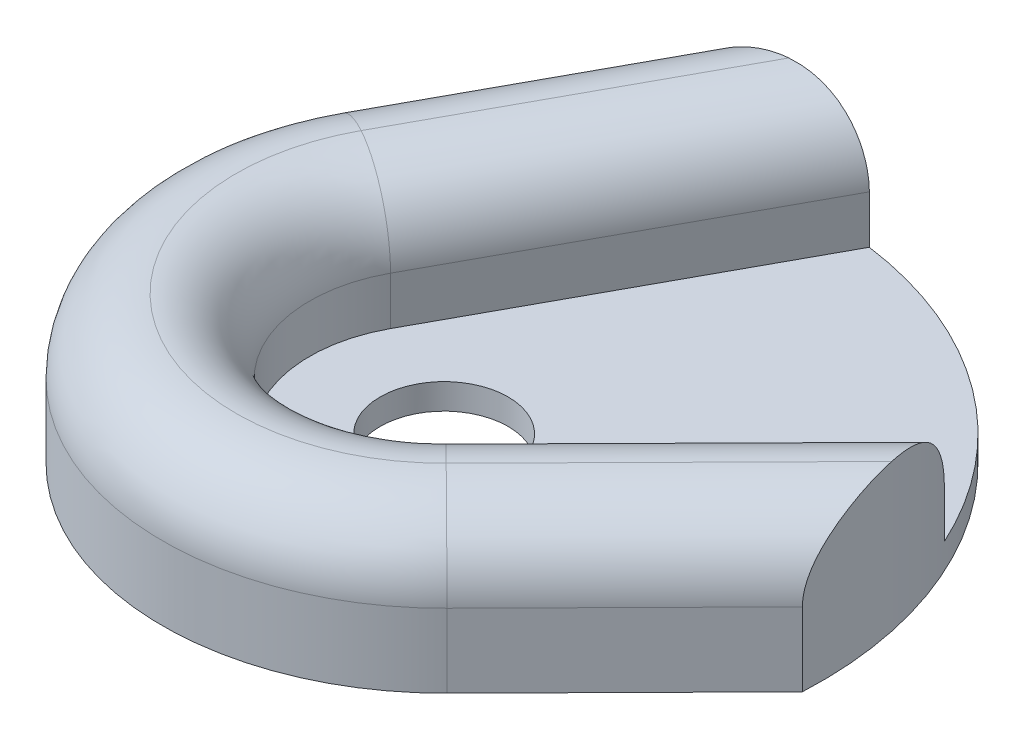
ISO-10303-21;
HEADER;
FILE_DESCRIPTION(('STEP AP214'),'2;1');
FILE_NAME('part.step','',(''),(''),'','','');
FILE_SCHEMA(('AUTOMOTIVE_DESIGN { 1 0 10303 214 1 1 1 1 }'));
ENDSEC;
DATA;
#1=APPLICATION_CONTEXT('core data for automotive mechanical design processes');
#2=APPLICATION_PROTOCOL_DEFINITION('international standard','automotive_design',2000,#1);
#3=PRODUCT_CONTEXT('',#1,'mechanical');
#4=PRODUCT('Part','Part','',(#3));
#5=PRODUCT_RELATED_PRODUCT_CATEGORY('part','',(#4));
#6=PRODUCT_DEFINITION_FORMATION('','',#4);
#7=PRODUCT_DEFINITION_CONTEXT('part definition',#1,'design');
#8=PRODUCT_DEFINITION('design','',#6,#7);
#9=PRODUCT_DEFINITION_SHAPE('','',#8);
#10=(LENGTH_UNIT() NAMED_UNIT(*) SI_UNIT(.MILLI.,.METRE.));
#11=(NAMED_UNIT(*) PLANE_ANGLE_UNIT() SI_UNIT($,.RADIAN.));
#12=(NAMED_UNIT(*) SI_UNIT($,.STERADIAN.) SOLID_ANGLE_UNIT());
#13=UNCERTAINTY_MEASURE_WITH_UNIT(LENGTH_MEASURE(1.E-05),#10,'distance_accuracy_value','');
#14=(GEOMETRIC_REPRESENTATION_CONTEXT(3) GLOBAL_UNCERTAINTY_ASSIGNED_CONTEXT((#13)) GLOBAL_UNIT_ASSIGNED_CONTEXT((#10,
#11,#12)) REPRESENTATION_CONTEXT('',''));
#15=CARTESIAN_POINT('',(0.,0.,0.));
#16=DIRECTION('',(0.,0.,1.));
#17=DIRECTION('',(1.,0.,0.));
#18=AXIS2_PLACEMENT_3D('',#15,#16,#17);
#19=CARTESIAN_POINT('',(12.5310818096461,9.2,12.3584782993809));
#20=DIRECTION('',(-0.711993287861168,0.,-0.702186270188078));
#21=DIRECTION('',(-0.702186270188078,0.,0.711993287861168));
#22=AXIS2_PLACEMENT_3D('',#19,#20,#21);
#23=PLANE('',#22);
#24=DIRECTION('',(0.,-1.,0.));
#25=VECTOR('',#24,1.);
#26=CARTESIAN_POINT('',(23.5673517207038,9.2,1.16807137559898));
#27=LINE('',#26,#25);
#28=CARTESIAN_POINT('',(23.5673517207038,4.6,1.16807137559898));
#29=VERTEX_POINT('',#28);
#30=CARTESIAN_POINT('',(23.5673517207038,0.,1.16807137559898));
#31=VERTEX_POINT('',#30);
#32=EDGE_CURVE('E131',#29,#31,#27,.T.);
#33=ORIENTED_EDGE('',*,*,#32,.F.);
#34=DIRECTION('',(0.702186270188078,0.,-0.711993287861168));
#35=VECTOR('',#34,1.);
#36=CARTESIAN_POINT('',(12.5310827207038,4.6,12.358477375599));
#37=LINE('',#36,#35);
#38=CARTESIAN_POINT('',(12.5310827207038,4.6,12.358477375599));
#39=VERTEX_POINT('',#38);
#40=EDGE_CURVE('E126',#29,#39,#37,.F.);
#41=ORIENTED_EDGE('',*,*,#40,.T.);
#42=DIRECTION('',(0.,-1.,0.));
#43=VECTOR('',#42,1.);
#44=CARTESIAN_POINT('',(12.5310827207038,9.2,12.358477375599));
#45=LINE('',#44,#43);
#46=CARTESIAN_POINT('',(12.5310827207038,0.,12.358477375599));
#47=VERTEX_POINT('',#46);
#48=EDGE_CURVE('E129',#39,#47,#45,.T.);
#49=ORIENTED_EDGE('',*,*,#48,.T.);
#50=DIRECTION('',(0.702186270188078,0.,-0.711993287861168));
#51=VECTOR('',#50,1.);
#52=CARTESIAN_POINT('',(12.5310818096461,0.,12.3584782993809));
#53=LINE('',#52,#51);
#54=EDGE_CURVE('E198',#47,#31,#53,.T.);
#55=ORIENTED_EDGE('',*,*,#54,.T.);
#56=EDGE_LOOP('',(#33,#41,#49,#55));
#57=FACE_BOUND('',#56,.T.);
#58=ADVANCED_FACE('F35',(#57),#23,.F.);
#59=CARTESIAN_POINT('',(5.9807435999558,9.2,5.8983644056314));
#60=DIRECTION('',(-0.711993302509726,0.,-0.702186255334931));
#61=DIRECTION('',(-0.702186255334931,0.,0.711993302509726));
#62=AXIS2_PLACEMENT_3D('',#59,#60,#61);
#63=PLANE('',#62);
#64=DIRECTION('',(0.,-1.,0.));
#65=VECTOR('',#64,1.);
#66=CARTESIAN_POINT('',(5.980744,9.2,5.898364));
#67=LINE('',#66,#65);
#68=CARTESIAN_POINT('',(5.980744,4.6,5.898364));
#69=VERTEX_POINT('',#68);
#70=CARTESIAN_POINT('',(5.980744,1.6,5.898364));
#71=VERTEX_POINT('',#70);
#72=EDGE_CURVE('E214',#69,#71,#67,.T.);
#73=ORIENTED_EDGE('',*,*,#72,.F.);
#74=DIRECTION('',(0.702186255334931,0.,-0.711993302509726));
#75=VECTOR('',#74,1.);
#76=CARTESIAN_POINT('',(5.9807435999558,4.6,5.8983644056314));
#77=LINE('',#76,#75);
#78=CARTESIAN_POINT('',(21.467503,4.6,-9.80469));
#79=VERTEX_POINT('',#78);
#80=EDGE_CURVE('E135',#69,#79,#77,.T.);
#81=ORIENTED_EDGE('',*,*,#80,.T.);
#82=DIRECTION('',(0.,-1.,0.));
#83=VECTOR('',#82,1.);
#84=CARTESIAN_POINT('',(21.467503,9.2,-9.80469));
#85=LINE('',#84,#83);
#86=CARTESIAN_POINT('',(21.467503,1.6,-9.80469));
#87=VERTEX_POINT('',#86);
#88=EDGE_CURVE('E81',#79,#87,#85,.T.);
#89=ORIENTED_EDGE('',*,*,#88,.T.);
#90=DIRECTION('',(0.702186255334931,0.,-0.711993302509726));
#91=VECTOR('',#90,1.);
#92=CARTESIAN_POINT('',(5.9807435999558,1.6,5.8983644056314));
#93=LINE('',#92,#91);
#94=EDGE_CURVE('E184',#71,#87,#93,.T.);
#95=ORIENTED_EDGE('',*,*,#94,.F.);
#96=EDGE_LOOP('',(#73,#81,#89,#95));
#97=FACE_BOUND('',#96,.T.);
#98=ADVANCED_FACE('F275',(#97),#63,.T.);
#99=CARTESIAN_POINT('',(0.,9.2,0.));
#100=DIRECTION('',(0.,-1.,0.));
#101=DIRECTION('',(0.,0.,-1.));
#102=AXIS2_PLACEMENT_3D('',#99,#100,#101);
#103=CYLINDRICAL_SURFACE('',#102,8.4);
#104=DIRECTION('',(0.,-1.,0.));
#105=VECTOR('',#104,1.);
#106=CARTESIAN_POINT('',(-7.37431239890417,9.2,-4.02237698921525));
#107=LINE('',#106,#105);
#108=CARTESIAN_POINT('',(-7.37431239890417,4.6,-4.02237698921525));
#109=VERTEX_POINT('',#108);
#110=CARTESIAN_POINT('',(-7.37431239890417,1.6,-4.02237698921525));
#111=VERTEX_POINT('',#110);
#112=EDGE_CURVE('E212',#109,#111,#107,.T.);
#113=ORIENTED_EDGE('',*,*,#112,.F.);
#114=CARTESIAN_POINT('',(0.,4.6,0.));
#115=DIRECTION('',(0.,1.,0.));
#116=DIRECTION('',(0.,0.,1.));
#117=AXIS2_PLACEMENT_3D('',#114,#115,#116);
#118=CIRCLE('',#117,8.4);
#119=EDGE_CURVE('E46',#109,#69,#118,.T.);
#120=ORIENTED_EDGE('',*,*,#119,.T.);
#121=ORIENTED_EDGE('',*,*,#72,.T.);
#122=CARTESIAN_POINT('',(0.,1.6,0.));
#123=DIRECTION('',(0.,1.,0.));
#124=DIRECTION('',(0.,0.,1.));
#125=AXIS2_PLACEMENT_3D('',#122,#123,#124);
#126=CIRCLE('',#125,8.4);
#127=EDGE_CURVE('E195',#111,#71,#126,.T.);
#128=ORIENTED_EDGE('',*,*,#127,.F.);
#129=EDGE_LOOP('',(#113,#120,#121,#128));
#130=FACE_BOUND('',#129,.T.);
#131=ADVANCED_FACE('F280',(#130),#103,.F.);
#132=CARTESIAN_POINT('',(-7.3743123171464,9.2,-4.02237713910356));
#133=DIRECTION('',(-0.877894323469809,0.,-0.478854421321853));
#134=DIRECTION('',(-0.478854421321853,0.,0.877894323469809));
#135=AXIS2_PLACEMENT_3D('',#132,#133,#134);
#136=PLANE('',#135);
#137=DIRECTION('',(0.,-1.,0.));
#138=VECTOR('',#137,1.);
#139=CARTESIAN_POINT('',(3.19067699999999,9.2,-23.391404));
#140=LINE('',#139,#138);
#141=CARTESIAN_POINT('',(3.19067699999999,4.6,-23.391404));
#142=VERTEX_POINT('',#141);
#143=CARTESIAN_POINT('',(3.19067699999999,1.6,-23.391404));
#144=VERTEX_POINT('',#143);
#145=EDGE_CURVE('E210',#142,#144,#140,.T.);
#146=ORIENTED_EDGE('',*,*,#145,.F.);
#147=DIRECTION('',(0.478854421321853,0.,-0.877894323469809));
#148=VECTOR('',#147,1.);
#149=CARTESIAN_POINT('',(-7.37431239890417,4.6,-4.02237698921525));
#150=LINE('',#149,#148);
#151=EDGE_CURVE('E11',#142,#109,#150,.F.);
#152=ORIENTED_EDGE('',*,*,#151,.T.);
#153=ORIENTED_EDGE('',*,*,#112,.T.);
#154=DIRECTION('',(0.478854421321853,0.,-0.877894323469809));
#155=VECTOR('',#154,1.);
#156=CARTESIAN_POINT('',(-7.3743123171464,1.6,-4.02237713910356));
#157=LINE('',#156,#155);
#158=EDGE_CURVE('E192',#111,#144,#157,.T.);
#159=ORIENTED_EDGE('',*,*,#158,.T.);
#160=EDGE_LOOP('',(#146,#152,#153,#159));
#161=FACE_BOUND('',#160,.T.);
#162=ADVANCED_FACE('F241',(#161),#136,.F.);
#163=CARTESIAN_POINT('',(-0.00329985887102813,9.2,-0.00853560341410042));
#164=DIRECTION('',(0.,-1.,0.));
#165=DIRECTION('',(0.,0.,-1.));
#166=AXIS2_PLACEMENT_3D('',#163,#164,#165);
#167=CYLINDRICAL_SURFACE('',#166,23.6000004209486);
#168=CARTESIAN_POINT('',(21.467503,4.6,-9.80469));
#169=CARTESIAN_POINT('',(21.4674898023379,4.72218263500441,-9.80470151167854));
#170=CARTESIAN_POINT('',(21.4696651354203,4.84436196253268,-9.79995074865216));
#171=CARTESIAN_POINT('',(21.4782970041608,5.08782097563913,-9.78100798464162));
#172=CARTESIAN_POINT('',(21.4847530577755,5.20910076095823,-9.76681704669615));
#173=CARTESIAN_POINT('',(21.5018343460081,5.44966737866498,-9.72911297444965));
#174=CARTESIAN_POINT('',(21.5124516554623,5.56895755268497,-9.70561755976055));
#175=CARTESIAN_POINT('',(21.5376709019737,5.80493088473364,-9.64946663704671));
#176=CARTESIAN_POINT('',(21.5522728319848,5.92161404737209,-9.61681114522038));
#177=CARTESIAN_POINT('',(21.5852154449569,6.15155400083514,-9.54256270737791));
#178=CARTESIAN_POINT('',(21.603556037519,6.26481087442976,-9.50096997745865));
#179=CARTESIAN_POINT('',(21.6436771468071,6.48717023190968,-9.40911630787178));
#180=CARTESIAN_POINT('',(21.6654589289987,6.59627116909747,-9.35885217874963));
#181=CARTESIAN_POINT('',(21.7120930493661,6.80952733306521,-9.25003069574351));
#182=CARTESIAN_POINT('',(21.7369445172457,6.91368395008482,-9.19147569174558));
#183=CARTESIAN_POINT('',(21.7893329562348,7.11647195895635,-9.0664475491831));
#184=CARTESIAN_POINT('',(21.8168709281258,7.21510127005807,-8.99997145778227));
#185=CARTESIAN_POINT('',(21.8746381124668,7.40769858888953,-8.85849464123467));
#186=CARTESIAN_POINT('',(21.9049023787391,7.50157083714142,-8.78337791134132));
#187=CARTESIAN_POINT('',(21.9672880563626,7.68250075199271,-8.62598624956744));
#188=CARTESIAN_POINT('',(21.9994101407176,7.76955592184767,-8.54370871813332));
#189=CARTESIAN_POINT('',(22.0650089904833,7.93635716950429,-8.37263398509699));
#190=CARTESIAN_POINT('',(22.0984850718296,8.0161068732836,-8.28384005767906));
#191=CARTESIAN_POINT('',(22.1663394300693,8.16804122165794,-8.10030410254734));
#192=CARTESIAN_POINT('',(22.2007180279235,8.24022312807857,-8.00555994161508));
#193=CARTESIAN_POINT('',(22.3083619050697,8.45261517729878,-7.70250578243193));
#194=CARTESIAN_POINT('',(22.3824321461185,8.57939792565875,-7.48487556365821));
#195=CARTESIAN_POINT('',(22.5287444268115,8.79729738649636,-7.03162503435976));
#196=CARTESIAN_POINT('',(22.6009834771312,8.88835890365014,-6.79597755014037));
#197=CARTESIAN_POINT('',(22.7092563626647,9.00239701415463,-6.4209639927069));
#198=CARTESIAN_POINT('',(22.7470326695792,9.03760925121989,-6.28567382662922));
#199=CARTESIAN_POINT('',(22.8207142440534,9.09756619927488,-6.01223646329629));
#200=CARTESIAN_POINT('',(22.8566190535765,9.12230835823087,-5.87408857808189));
#201=CARTESIAN_POINT('',(22.926106374048,9.16153328129565,-5.59626960319984));
#202=CARTESIAN_POINT('',(22.9596959876419,9.17604881020632,-5.45660484729957));
#203=CARTESIAN_POINT('',(23.024440285956,9.1952798768029,-5.17612848308667));
#204=CARTESIAN_POINT('',(23.0555964585815,9.20000144877888,-5.03531763463672));
#205=CARTESIAN_POINT('',(23.0854373929497,9.2,-4.89425274475206));
#206=B_SPLINE_CURVE_WITH_KNOTS('',3,(#168,#169,#170,#171,#172,#173,#174,#175,#176,#177,#178,
#179,#180,#181,#182,#183,#184,#185,#186,#187,#188,#189,#190,#191,#192,#193,#194,#195,#196,#197,
#198,#199,#200,#201,#202,#203,#204,#205),.UNSPECIFIED.,.F.,.F.,(4,2,2,2,2,2,2,2,2,2,2,2,2,2,2,2,
2,2,4),(0.,0.366431313187995,0.732821370282576,1.09851699747624,1.46421197798909,
1.82989811721902,2.1957190485071,2.56143650180307,2.92729071691162,3.2988068339102,
3.67045838783133,4.04192446613973,4.41352448751463,5.19761427312711,5.98291088180405,
6.41697948046758,6.85115382051282,7.28393071726003,7.71644089055933),.UNSPECIFIED.);
#207=CARTESIAN_POINT('',(23.0854373929497,9.2,-4.89425274475206));
#208=VERTEX_POINT('',#207);
#209=EDGE_CURVE('E162',#79,#208,#206,.T.);
#210=ORIENTED_EDGE('',*,*,#209,.T.);
#211=CARTESIAN_POINT('',(23.0854375243091,9.2,-4.89425212397864));
#212=CARTESIAN_POINT('',(23.1259384010995,9.19998631606007,-4.70296841263943));
#213=CARTESIAN_POINT('',(23.1640027306928,9.19132181017179,-4.51123871447719));
#214=CARTESIAN_POINT('',(23.2351231752472,9.15748111419279,-4.12840224487034));
#215=CARTESIAN_POINT('',(23.268181884472,9.13231351346666,-3.9372952013233));
#216=CARTESIAN_POINT('',(23.3292586009731,9.06618969811427,-3.55664143903222));
#217=CARTESIAN_POINT('',(23.3572665217998,9.02520239273205,-3.36709854831293));
#218=CARTESIAN_POINT('',(23.4082259830963,8.92807310313201,-2.99122400095673));
#219=CARTESIAN_POINT('',(23.4311769010603,8.87192925506824,-2.80489274226398));
#220=CARTESIAN_POINT('',(23.4717572684718,8.74627814365969,-2.44053615416107));
#221=CARTESIAN_POINT('',(23.4894864818808,8.67706956623883,-2.26241881135988));
#222=CARTESIAN_POINT('',(23.5204908505684,8.52485508353725,-1.91176220384733));
#223=CARTESIAN_POINT('',(23.5337657536903,8.44184839754869,-1.73922325542613));
#224=CARTESIAN_POINT('',(23.5561792053937,8.26219062246318,-1.40123697771826));
#225=CARTESIAN_POINT('',(23.5653204057273,8.16554833290669,-1.23578516391806));
#226=CARTESIAN_POINT('',(23.5798907734657,7.95854626702664,-0.9136107368557));
#227=CARTESIAN_POINT('',(23.5853212619438,7.84819138915942,-0.756885035228516));
#228=CARTESIAN_POINT('',(23.5945420115075,7.56550948927805,-0.392229907593574));
#229=CARTESIAN_POINT('',(23.596757683237,7.38627440591578,-0.189516182467687));
#230=CARTESIAN_POINT('',(23.5966413259123,6.99931048475923,0.186581770224533));
#231=CARTESIAN_POINT('',(23.5943167509033,6.79162887016265,0.360013564154688));
#232=CARTESIAN_POINT('',(23.5883764536502,6.40208435622498,0.628917203635093));
#233=CARTESIAN_POINT('',(23.5852132831322,6.22625871068525,0.733088252018186));
#234=CARTESIAN_POINT('',(23.5789265955684,5.86033652874399,0.911588147724089));
#235=CARTESIAN_POINT('',(23.5758029885032,5.67028403846402,0.986004918584085));
#236=CARTESIAN_POINT('',(23.5714625109453,5.33335702134822,1.08338259911345));
#237=CARTESIAN_POINT('',(23.5699576048515,5.18895096027725,1.11486087482709));
#238=CARTESIAN_POINT('',(23.5684140377155,4.96977553314377,1.1466386620942));
#239=CARTESIAN_POINT('',(23.5680183837301,4.89607991692234,1.15465858062636));
#240=CARTESIAN_POINT('',(23.5674861226157,4.74826387024133,1.16538142301408));
#241=CARTESIAN_POINT('',(23.5673496516848,4.67414323694706,1.16808155140412));
#242=CARTESIAN_POINT('',(23.5673517207038,4.6,1.16807137559897));
#243=B_SPLINE_CURVE_WITH_KNOTS('',3,(#211,#212,#213,#214,#215,#216,#217,#218,#219,#220,#221,
#222,#223,#224,#225,#226,#227,#228,#229,#230,#231,#232,#233,#234,#235,#236,#237,#238,#239,#240,
#241,#242),.UNSPECIFIED.,.F.,.F.,(4,2,2,2,2,2,2,2,2,2,2,2,2,2,2,4),(0.,0.586268837856312,
1.17223278234868,1.75935424514063,2.3465479409511,2.92166139109092,3.49680739268498,
4.07158391543136,4.64615570170771,5.45528483487194,6.2630866799212,6.87407941738357,
7.48325309306726,7.92520546658378,8.1474262659654,8.36976380774762),.UNSPECIFIED.);
#244=EDGE_CURVE('E160',#208,#29,#243,.T.);
#245=ORIENTED_EDGE('',*,*,#244,.T.);
#246=ORIENTED_EDGE('',*,*,#32,.T.);
#247=CARTESIAN_POINT('',(-0.00329985887102813,0.,-0.00853560341410042));
#248=DIRECTION('',(0.,1.,0.));
#249=DIRECTION('',(0.,0.,1.));
#250=AXIS2_PLACEMENT_3D('',#247,#248,#249);
#251=CIRCLE('',#250,23.6000004209486);
#252=CARTESIAN_POINT('',(-7.91553255647974,0.,-22.2426668796225));
#253=VERTEX_POINT('',#252);
#254=EDGE_CURVE('E200',#31,#253,#251,.T.);
#255=ORIENTED_EDGE('',*,*,#254,.T.);
#256=DIRECTION('',(0.,-1.,0.));
#257=VECTOR('',#256,1.);
#258=CARTESIAN_POINT('',(-7.91553255647974,9.2,-22.2426668796225));
#259=LINE('',#258,#257);
#260=CARTESIAN_POINT('',(-7.91553255647974,4.6,-22.2426668796225));
#261=VERTEX_POINT('',#260);
#262=EDGE_CURVE('E208',#261,#253,#259,.T.);
#263=ORIENTED_EDGE('',*,*,#262,.F.);
#264=CARTESIAN_POINT('',(-7.91553255647974,4.6,-22.2426668796225));
#265=CARTESIAN_POINT('',(-7.91557885755004,4.70242384190015,-22.2426433171082));
#266=CARTESIAN_POINT('',(-7.91069906329193,4.80481715967899,-22.2443868088882));
#267=CARTESIAN_POINT('',(-7.89144793519104,5.00847320881552,-22.2512271503045));
#268=CARTESIAN_POINT('',(-7.87708818127801,5.10973716643657,-22.2563199087265));
#269=CARTESIAN_POINT('',(-7.8394461558265,5.30920665753011,-22.269604736098));
#270=CARTESIAN_POINT('',(-7.81626464154892,5.40743365821972,-22.2777617932802));
#271=CARTESIAN_POINT('',(-7.761575196746,5.60125209501987,-22.2968739860358));
#272=CARTESIAN_POINT('',(-7.73006520332302,5.69684287167173,-22.30782981482));
#273=CARTESIAN_POINT('',(-7.62439441595086,5.97783957626751,-22.3442571342709));
#274=CARTESIAN_POINT('',(-7.5388678575445,6.15859710295448,-22.3733702007476));
#275=CARTESIAN_POINT('',(-7.34305335093511,6.50512019480236,-22.4383981279616));
#276=CARTESIAN_POINT('',(-7.23268725268435,6.67083607516975,-22.4743343987826));
#277=CARTESIAN_POINT('',(-6.9297904992288,7.06824804600811,-22.5700089259828));
#278=CARTESIAN_POINT('',(-6.72434898839401,7.2895366388219,-22.6324188217811));
#279=CARTESIAN_POINT('',(-6.39205688553201,7.59393342053467,-22.7276320951169));
#280=CARTESIAN_POINT('',(-6.27708258452282,7.69093305274689,-22.7596850159498));
#281=CARTESIAN_POINT('',(-6.04006579488679,7.87597803677617,-22.8237166458183));
#282=CARTESIAN_POINT('',(-5.91802354098573,7.96402368568648,-22.8556953572817));
#283=CARTESIAN_POINT('',(-5.63351758844409,8.15419358917379,-22.9276916657976));
#284=CARTESIAN_POINT('',(-5.46915323625959,8.25354929533336,-22.9675066486231));
#285=CARTESIAN_POINT('',(-5.1321092511436,8.43796746307304,-23.0451426096239));
#286=CARTESIAN_POINT('',(-4.95942718607408,8.52302571096569,-23.0829629977149));
#287=CARTESIAN_POINT('',(-4.60732251137289,8.67862191499666,-23.1557872345748));
#288=CARTESIAN_POINT('',(-4.42790836521856,8.74917742529998,-23.1907944567601));
#289=CARTESIAN_POINT('',(-4.06335978818151,8.87560072529651,-23.2574137277712));
#290=CARTESIAN_POINT('',(-3.87822401363293,8.93146503516777,-23.2890249711637));
#291=CARTESIAN_POINT('',(-3.41205071704467,9.05152997919699,-23.3627598733858));
#292=CARTESIAN_POINT('',(-3.12817319309946,9.10656532105986,-23.4025165196824));
#293=CARTESIAN_POINT('',(-2.69831103705887,9.16222978287939,-23.4545982634198));
#294=CARTESIAN_POINT('',(-2.55439271461414,9.17630298665592,-23.47069631032));
#295=CARTESIAN_POINT('',(-2.26562260243353,9.19518607124823,-23.500300288989));
#296=CARTESIAN_POINT('',(-2.12077042600778,9.19999182944393,-23.5138050647378));
#297=CARTESIAN_POINT('',(-1.97573661376641,9.2,-23.5259655887827));
#298=B_SPLINE_CURVE_WITH_KNOTS('',3,(#264,#265,#266,#267,#268,#269,#270,#271,#272,#273,#274,
#275,#276,#277,#278,#279,#280,#281,#282,#283,#284,#285,#286,#287,#288,#289,#290,#291,#292,#293,
#294,#295,#296,#297),.UNSPECIFIED.,.F.,.F.,(4,2,2,2,2,2,2,2,2,2,2,2,2,2,2,2,4),(0.,
0.307091263149187,0.613808101528891,0.917122107227627,1.2205113118972,1.82387980254244,
2.42917382456638,3.34869438545819,3.80982530516436,4.27094091954671,4.8586174785369,
5.44646693259823,6.03360060634432,6.62087322613333,7.49383896133191,7.93006260521656,
8.36648025831999),.UNSPECIFIED.);
#299=CARTESIAN_POINT('',(-1.97573590237995,9.2,-23.5259656484476));
#300=VERTEX_POINT('',#299);
#301=EDGE_CURVE('E227',#261,#300,#298,.T.);
#302=ORIENTED_EDGE('',*,*,#301,.T.);
#303=CARTESIAN_POINT('',(-1.97573590237995,9.2,-23.5259656484476));
#304=CARTESIAN_POINT('',(-1.81522312929044,9.20000433250762,-23.5394429893028));
#305=CARTESIAN_POINT('',(-1.65452796322055,9.19410344188448,-23.5512513085206));
#306=CARTESIAN_POINT('',(-1.33373255261097,9.17002257717474,-23.5715496781459));
#307=CARTESIAN_POINT('',(-1.17363285502349,9.15183324524625,-23.5800371919236));
#308=CARTESIAN_POINT('',(-0.854215001162125,9.10254788709383,-23.5937370066208));
#309=CARTESIAN_POINT('',(-0.694908444688659,9.07136982299558,-23.5989279504502));
#310=CARTESIAN_POINT('',(-0.379434266170933,8.99571208968849,-23.6060654863682));
#311=CARTESIAN_POINT('',(-0.223265942437692,8.95123543008678,-23.608012811866));
#312=CARTESIAN_POINT('',(0.0853807378109732,8.8484194472,-23.6088766601422));
#313=CARTESIAN_POINT('',(0.237835375441189,8.79000846486184,-23.6077771933976));
#314=CARTESIAN_POINT('',(0.536637319073916,8.65932577040422,-23.6028317634726));
#315=CARTESIAN_POINT('',(0.682985331253936,8.58705566640921,-23.5989861188003));
#316=CARTESIAN_POINT('',(0.967548942852086,8.42895921482192,-23.588986993231));
#317=CARTESIAN_POINT('',(1.10578674637302,8.34317250217534,-23.5828401897201));
#318=CARTESIAN_POINT('',(1.37290531390542,8.15822881482691,-23.5687555639415));
#319=CARTESIAN_POINT('',(1.50178784882205,8.0590743807744,-23.5608180818148));
#320=CARTESIAN_POINT('',(1.73262922019123,7.86162852994303,-23.5448519580286));
#321=CARTESIAN_POINT('',(1.83591662068725,7.76487526108677,-23.5369671158399));
#322=CARTESIAN_POINT('',(2.03309809991143,7.5622712435066,-23.5207215636163));
#323=CARTESIAN_POINT('',(2.12699342833023,7.45642170860776,-23.5123609171238));
#324=CARTESIAN_POINT('',(2.30445484589441,7.23630949710983,-23.4956009985424));
#325=CARTESIAN_POINT('',(2.38801619995587,7.12204300179481,-23.4872017105625));
#326=CARTESIAN_POINT('',(2.54386168811348,6.88603942900268,-23.4708059847378));
#327=CARTESIAN_POINT('',(2.61614699711886,6.76430313168689,-23.4628095049812));
#328=CARTESIAN_POINT('',(2.74215610755428,6.52667111352915,-23.4483758290979));
#329=CARTESIAN_POINT('',(2.79700546518076,6.41137528700512,-23.4418626229916));
#330=CARTESIAN_POINT('',(2.89642172003615,6.17639080477494,-23.4297683703266));
#331=CARTESIAN_POINT('',(2.94098957349561,6.05670255878651,-23.4241872370938));
#332=CARTESIAN_POINT('',(3.01939571559891,5.81401245134632,-23.4141950299749));
#333=CARTESIAN_POINT('',(3.05324982251327,5.69101576871898,-23.4097822326925));
#334=CARTESIAN_POINT('',(3.11001119493075,5.44253219000273,-23.4022983019236));
#335=CARTESIAN_POINT('',(3.13292353086093,5.31704647546734,-23.3992265470534));
#336=CARTESIAN_POINT('',(3.16372900780499,5.09286823744492,-23.3950731266527));
#337=CARTESIAN_POINT('',(3.17383828345896,4.99447962281569,-23.3936996178204));
#338=CARTESIAN_POINT('',(3.18730913723024,4.7973968100488,-23.3918639313671));
#339=CARTESIAN_POINT('',(3.19068184907448,4.69870338657456,-23.3914002500685));
#340=CARTESIAN_POINT('',(3.1906769700592,4.59999999690276,-23.3914039451089));
#341=B_SPLINE_CURVE_WITH_KNOTS('',3,(#303,#304,#305,#306,#307,#308,#309,#310,#311,#312,#313,
#314,#315,#316,#317,#318,#319,#320,#321,#322,#323,#324,#325,#326,#327,#328,#329,#330,#331,#332,
#333,#334,#335,#336,#337,#338,#339,#340),.UNSPECIFIED.,.F.,.F.,(4,2,2,2,2,2,2,2,2,2,2,2,2,2,2,2,
2,2,4),(0.,0.483179113661493,0.966726591209302,1.45337564282477,1.93991464407203,2.429011823592,
2.9180522856833,3.40568453780052,3.89322424156458,4.31788220762591,4.74248359415917,
5.16727882015887,5.59202975494846,5.97508174897102,6.35809810289471,6.74054628658084,
7.12281707102482,7.4193396745988,7.7153717992562),.UNSPECIFIED.);
#342=EDGE_CURVE('E221',#300,#142,#341,.T.);
#343=ORIENTED_EDGE('',*,*,#342,.T.);
#344=ORIENTED_EDGE('',*,*,#145,.T.);
#345=CARTESIAN_POINT('',(-0.00329985887102813,1.6,-0.00853560341410042));
#346=DIRECTION('',(0.,1.,0.));
#347=DIRECTION('',(0.,0.,1.));
#348=AXIS2_PLACEMENT_3D('',#345,#346,#347);
#349=CIRCLE('',#348,23.6000004209486);
#350=EDGE_CURVE('E189',#87,#144,#349,.T.);
#351=ORIENTED_EDGE('',*,*,#350,.F.);
#352=ORIENTED_EDGE('',*,*,#88,.F.);
#353=EDGE_LOOP('',(#210,#245,#246,#255,#263,#302,#343,#344,#351,#352));
#354=FACE_BOUND('',#353,.T.);
#355=ADVANCED_FACE('F235',(#354),#167,.T.);
#356=CARTESIAN_POINT('',(-15.4509403479286,9.2,-8.42783734802429));
#357=DIRECTION('',(-0.877894337950487,0.,-0.478854394774107));
#358=DIRECTION('',(-0.478854394774107,0.,0.877894337950487));
#359=AXIS2_PLACEMENT_3D('',#356,#357,#358);
#360=PLANE('',#359);
#361=DIRECTION('',(0.,-1.,0.));
#362=VECTOR('',#361,1.);
#363=CARTESIAN_POINT('',(-15.4509402643706,9.2,-8.4278375012129));
#364=LINE('',#363,#362);
#365=CARTESIAN_POINT('',(-15.4509402643706,4.6,-8.4278375012129));
#366=VERTEX_POINT('',#365);
#367=CARTESIAN_POINT('',(-15.4509402643706,0.,-8.4278375012129));
#368=VERTEX_POINT('',#367);
#369=EDGE_CURVE('E145',#366,#368,#364,.T.);
#370=ORIENTED_EDGE('',*,*,#369,.F.);
#371=DIRECTION('',(0.478854394774107,0.,-0.877894337950487));
#372=VECTOR('',#371,1.);
#373=CARTESIAN_POINT('',(-15.4509403479286,4.6,-8.42783734802429));
#374=LINE('',#373,#372);
#375=EDGE_CURVE('E217',#366,#261,#374,.T.);
#376=ORIENTED_EDGE('',*,*,#375,.T.);
#377=ORIENTED_EDGE('',*,*,#262,.T.);
#378=DIRECTION('',(0.478854394774107,0.,-0.877894337950487));
#379=VECTOR('',#378,1.);
#380=CARTESIAN_POINT('',(-15.4509403479286,0.,-8.42783734802429));
#381=LINE('',#380,#379);
#382=EDGE_CURVE('E203',#368,#253,#381,.T.);
#383=ORIENTED_EDGE('',*,*,#382,.F.);
#384=EDGE_LOOP('',(#370,#376,#377,#383));
#385=FACE_BOUND('',#384,.T.);
#386=ADVANCED_FACE('F240',(#385),#360,.T.);
#387=CARTESIAN_POINT('',(0.,9.2,0.));
#388=DIRECTION('',(0.,-1.,0.));
#389=DIRECTION('',(0.,0.,-1.));
#390=AXIS2_PLACEMENT_3D('',#387,#388,#389);
#391=CYLINDRICAL_SURFACE('',#390,17.6);
#392=ORIENTED_EDGE('',*,*,#48,.F.);
#393=CARTESIAN_POINT('',(0.,4.6,0.));
#394=DIRECTION('',(0.,1.,0.));
#395=DIRECTION('',(0.,0.,1.));
#396=AXIS2_PLACEMENT_3D('',#393,#394,#395);
#397=CIRCLE('',#396,17.6);
#398=EDGE_CURVE('E136',#39,#366,#397,.F.);
#399=ORIENTED_EDGE('',*,*,#398,.T.);
#400=ORIENTED_EDGE('',*,*,#369,.T.);
#401=CARTESIAN_POINT('',(0.,0.,0.));
#402=DIRECTION('',(0.,1.,0.));
#403=DIRECTION('',(0.,0.,1.));
#404=AXIS2_PLACEMENT_3D('',#401,#402,#403);
#405=CIRCLE('',#404,17.6);
#406=EDGE_CURVE('E143',#368,#47,#405,.T.);
#407=ORIENTED_EDGE('',*,*,#406,.T.);
#408=EDGE_LOOP('',(#392,#399,#400,#407));
#409=FACE_BOUND('',#408,.T.);
#410=ADVANCED_FACE('F139',(#409),#391,.T.);
#411=CARTESIAN_POINT('',(0.,0.,0.));
#412=DIRECTION('',(0.,1.,0.));
#413=DIRECTION('',(0.,0.,1.));
#414=AXIS2_PLACEMENT_3D('',#411,#412,#413);
#415=PLANE('',#414);
#416=CARTESIAN_POINT('',(0.,0.,0.));
#417=DIRECTION('',(0.,-1.,0.));
#418=DIRECTION('',(0.,0.,-1.));
#419=AXIS2_PLACEMENT_3D('',#416,#417,#418);
#420=CIRCLE('',#419,4.);
#421=CARTESIAN_POINT('',(0.,0.,-4.));
#422=VERTEX_POINT('',#421);
#423=EDGE_CURVE('E177',#422,#422,#420,.T.);
#424=ORIENTED_EDGE('',*,*,#423,.F.);
#425=EDGE_LOOP('',(#424));
#426=FACE_BOUND('',#425,.T.);
#427=ORIENTED_EDGE('',*,*,#254,.F.);
#428=ORIENTED_EDGE('',*,*,#54,.F.);
#429=ORIENTED_EDGE('',*,*,#406,.F.);
#430=ORIENTED_EDGE('',*,*,#382,.T.);
#431=EDGE_LOOP('',(#427,#428,#429,#430));
#432=FACE_BOUND('',#431,.T.);
#433=ADVANCED_FACE('F262',(#426,#432),#415,.F.);
#434=CARTESIAN_POINT('',(0.,1.6,0.));
#435=DIRECTION('',(0.,1.,0.));
#436=DIRECTION('',(0.,0.,1.));
#437=AXIS2_PLACEMENT_3D('',#434,#435,#436);
#438=PLANE('',#437);
#439=CARTESIAN_POINT('',(0.,1.6,0.));
#440=DIRECTION('',(0.,1.,0.));
#441=DIRECTION('',(0.,0.,1.));
#442=AXIS2_PLACEMENT_3D('',#439,#440,#441);
#443=CIRCLE('',#442,4.);
#444=CARTESIAN_POINT('',(0.,1.6,4.));
#445=VERTEX_POINT('',#444);
#446=EDGE_CURVE('E179',#445,#445,#443,.T.);
#447=ORIENTED_EDGE('',*,*,#446,.F.);
#448=EDGE_LOOP('',(#447));
#449=FACE_BOUND('',#448,.T.);
#450=ORIENTED_EDGE('',*,*,#94,.T.);
#451=ORIENTED_EDGE('',*,*,#350,.T.);
#452=ORIENTED_EDGE('',*,*,#158,.F.);
#453=ORIENTED_EDGE('',*,*,#127,.T.);
#454=EDGE_LOOP('',(#450,#451,#452,#453));
#455=FACE_BOUND('',#454,.T.);
#456=ADVANCED_FACE('F264',(#449,#455),#438,.T.);
#457=CARTESIAN_POINT('',(0.,9.2,0.));
#458=DIRECTION('',(0.,-1.,0.));
#459=DIRECTION('',(0.,0.,-1.));
#460=AXIS2_PLACEMENT_3D('',#457,#458,#459);
#461=CYLINDRICAL_SURFACE('',#460,4.);
#462=ORIENTED_EDGE('',*,*,#446,.T.);
#463=EDGE_LOOP('',(#462));
#464=FACE_BOUND('',#463,.T.);
#465=ORIENTED_EDGE('',*,*,#423,.T.);
#466=EDGE_LOOP('',(#465));
#467=FACE_BOUND('',#466,.T.);
#468=ADVANCED_FACE('F271',(#464,#467),#461,.F.);
#469=CARTESIAN_POINT('',(9.25591279150054,4.6,9.12842118017208));
#470=DIRECTION('',(0.702186255334931,0.,-0.711993302509726));
#471=DIRECTION('',(-0.711993302509726,0.,-0.702186255334931));
#472=AXIS2_PLACEMENT_3D('',#469,#470,#471);
#473=CYLINDRICAL_SURFACE('',#472,4.6);
#474=ORIENTED_EDGE('',*,*,#209,.F.);
#475=ORIENTED_EDGE('',*,*,#80,.F.);
#476=CARTESIAN_POINT('',(9.25591319154474,4.6,9.12842077454069));
#477=DIRECTION('',(-0.702186255334931,0.,0.711993302509726));
#478=DIRECTION('',(0.711993302509726,0.,0.702186255334931));
#479=AXIS2_PLACEMENT_3D('',#476,#477,#478);
#480=CIRCLE('',#479,4.6);
#481=CARTESIAN_POINT('',(9.2559134151355,9.2,9.1284208301061));
#482=VERTEX_POINT('',#481);
#483=EDGE_CURVE('E40',#482,#69,#480,.T.);
#484=ORIENTED_EDGE('',*,*,#483,.F.);
#485=DIRECTION('',(0.702186255334931,0.,-0.711993302509726));
#486=VECTOR('',#485,1.);
#487=CARTESIAN_POINT('',(9.25591279150054,9.2,9.12842118017208));
#488=LINE('',#487,#486);
#489=EDGE_CURVE('E150',#208,#482,#488,.F.);
#490=ORIENTED_EDGE('',*,*,#489,.F.);
#491=EDGE_LOOP('',(#474,#475,#484,#490));
#492=FACE_BOUND('',#491,.T.);
#493=ADVANCED_FACE('F37',(#492),#473,.T.);
#494=CARTESIAN_POINT('',(0.,4.6,0.));
#495=DIRECTION('',(0.,1.,0.));
#496=DIRECTION('',(0.,0.,1.));
#497=AXIS2_PLACEMENT_3D('',#494,#495,#496);
#498=TOROIDAL_SURFACE('',#497,13.,4.6);
#499=ORIENTED_EDGE('',*,*,#483,.T.);
#500=ORIENTED_EDGE('',*,*,#119,.F.);
#501=CARTESIAN_POINT('',(-11.4126263316374,4.6,-6.22510724521407));
#502=DIRECTION('',(0.478854403478005,0.,-0.877894333202877));
#503=DIRECTION('',(-0.877894333202877,0.,-0.478854403478005));
#504=AXIS2_PLACEMENT_3D('',#501,#502,#503);
#505=CIRCLE('',#504,4.6);
#506=CARTESIAN_POINT('',(-11.4126263097984,9.2,-6.225107285252));
#507=VERTEX_POINT('',#506);
#508=EDGE_CURVE('E65',#507,#109,#505,.T.);
#509=ORIENTED_EDGE('',*,*,#508,.F.);
#510=CARTESIAN_POINT('',(0.,9.2,0.));
#511=DIRECTION('',(0.,1.,0.));
#512=DIRECTION('',(0.,0.,1.));
#513=AXIS2_PLACEMENT_3D('',#510,#511,#512);
#514=CIRCLE('',#513,13.);
#515=EDGE_CURVE('E152',#482,#507,#514,.F.);
#516=ORIENTED_EDGE('',*,*,#515,.F.);
#517=EDGE_LOOP('',(#499,#500,#509,#516));
#518=FACE_BOUND('',#517,.T.);
#519=ADVANCED_FACE('F291',(#518),#498,.T.);
#520=CARTESIAN_POINT('',(9.25591268548473,4.6,9.1284214565157));
#521=DIRECTION('',(-0.702186270188078,0.,0.711993287861168));
#522=DIRECTION('',(0.711993287861168,0.,0.702186270188078));
#523=AXIS2_PLACEMENT_3D('',#520,#521,#522);
#524=CYLINDRICAL_SURFACE('',#523,4.6);
#525=ORIENTED_EDGE('',*,*,#244,.F.);
#526=ORIENTED_EDGE('',*,*,#489,.T.);
#527=CARTESIAN_POINT('',(9.25591359654242,4.6,9.12842053273381));
#528=DIRECTION('',(-0.702186270188076,-7.37192446492714E-08,0.711993287861166));
#529=DIRECTION('',(0.711993287861167,0.,0.702186270188078));
#530=AXIS2_PLACEMENT_3D('',#527,#528,#529);
#531=CIRCLE('',#530,4.6);
#532=EDGE_CURVE('E148',#39,#482,#531,.T.);
#533=ORIENTED_EDGE('',*,*,#532,.F.);
#534=ORIENTED_EDGE('',*,*,#40,.F.);
#535=EDGE_LOOP('',(#525,#526,#533,#534));
#536=FACE_BOUND('',#535,.T.);
#537=ADVANCED_FACE('F149',(#536),#524,.T.);
#538=CARTESIAN_POINT('',(-11.4126262051075,4.6,-6.22510747718408));
#539=DIRECTION('',(-0.478854421321853,0.,0.877894323469809));
#540=DIRECTION('',(0.877894323469809,0.,0.478854421321853));
#541=AXIS2_PLACEMENT_3D('',#538,#539,#540);
#542=CYLINDRICAL_SURFACE('',#541,4.6);
#543=ORIENTED_EDGE('',*,*,#151,.F.);
#544=ORIENTED_EDGE('',*,*,#342,.F.);
#545=DIRECTION('',(0.478854421321853,0.,-0.877894323469809));
#546=VECTOR('',#545,1.);
#547=CARTESIAN_POINT('',(-0.847636887961129,9.2,-25.5941343380805));
#548=LINE('',#547,#546);
#549=EDGE_CURVE('E153',#507,#300,#548,.T.);
#550=ORIENTED_EDGE('',*,*,#549,.F.);
#551=ORIENTED_EDGE('',*,*,#508,.T.);
#552=EDGE_LOOP('',(#543,#544,#550,#551));
#553=FACE_BOUND('',#552,.T.);
#554=ADVANCED_FACE('F232',(#553),#542,.T.);
#555=CARTESIAN_POINT('',(0.,4.6,0.));
#556=DIRECTION('',(0.,1.,0.));
#557=DIRECTION('',(0.,0.,1.));
#558=AXIS2_PLACEMENT_3D('',#555,#556,#557);
#559=TOROIDAL_SURFACE('',#558,13.,4.6);
#560=ORIENTED_EDGE('',*,*,#532,.T.);
#561=ORIENTED_EDGE('',*,*,#515,.T.);
#562=CARTESIAN_POINT('',(-11.4126263316374,4.6,-6.22510724521407));
#563=DIRECTION('',(0.478854403478005,-9.91451664706984E-09,-0.877894333202877));
#564=DIRECTION('',(-0.877894333202877,0.,-0.478854403478005));
#565=AXIS2_PLACEMENT_3D('',#562,#563,#564);
#566=CIRCLE('',#565,4.6);
#567=EDGE_CURVE('E158',#366,#507,#566,.T.);
#568=ORIENTED_EDGE('',*,*,#567,.F.);
#569=ORIENTED_EDGE('',*,*,#398,.F.);
#570=EDGE_LOOP('',(#560,#561,#568,#569));
#571=FACE_BOUND('',#570,.T.);
#572=ADVANCED_FACE('F156',(#571),#559,.T.);
#573=CARTESIAN_POINT('',(-11.4126263933563,4.6,-6.2251071320634));
#574=DIRECTION('',(0.478854394774107,0.,-0.877894337950487));
#575=DIRECTION('',(-0.877894337950487,0.,-0.478854394774107));
#576=AXIS2_PLACEMENT_3D('',#573,#574,#575);
#577=CYLINDRICAL_SURFACE('',#576,4.6);
#578=ORIENTED_EDGE('',*,*,#567,.T.);
#579=ORIENTED_EDGE('',*,*,#549,.T.);
#580=ORIENTED_EDGE('',*,*,#301,.F.);
#581=ORIENTED_EDGE('',*,*,#375,.F.);
#582=EDGE_LOOP('',(#578,#579,#580,#581));
#583=FACE_BOUND('',#582,.T.);
#584=ADVANCED_FACE('F257',(#583),#577,.T.);
#585=CLOSED_SHELL('',(#58,#98,#131,#162,#355,#386,#410,#433,#456,#468,#493,#519,#537,#554,#572,#584));
#586=MANIFOLD_SOLID_BREP('B2',#585);
#587=ADVANCED_BREP_SHAPE_REPRESENTATION('',(#18,#586),#14);
#588=SHAPE_DEFINITION_REPRESENTATION(#9,#587);
ENDSEC;
END-ISO-10303-21;
